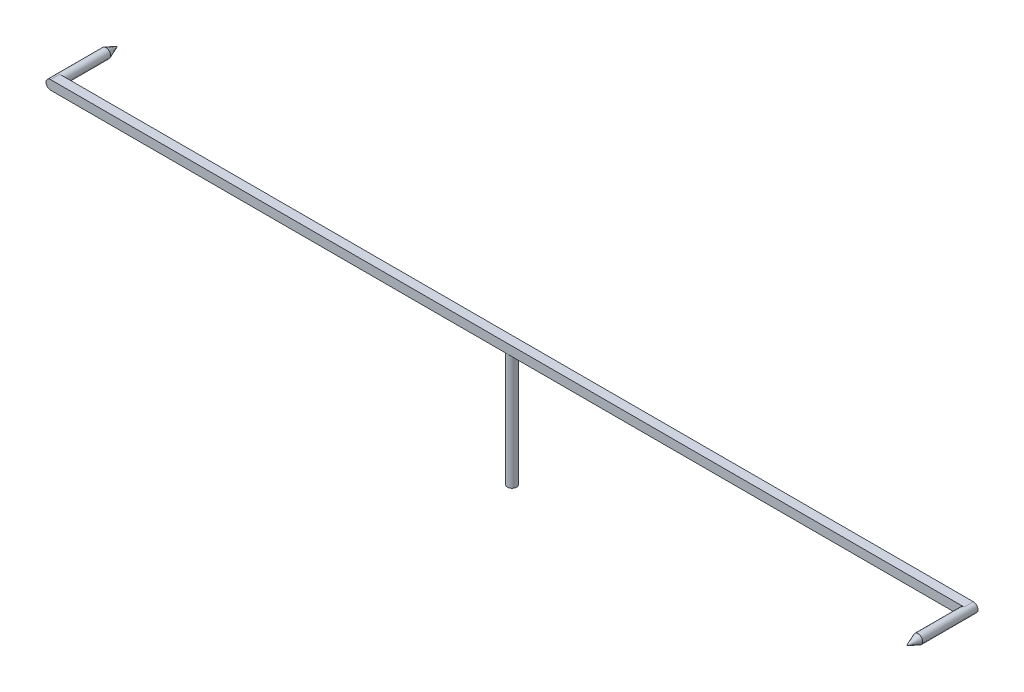
ISO-10303-21;
HEADER;
FILE_DESCRIPTION(('STEP AP214'),'2;1');
FILE_NAME('part.step','',(''),(''),'','','');
FILE_SCHEMA(('AUTOMOTIVE_DESIGN { 1 0 10303 214 1 1 1 1 }'));
ENDSEC;
DATA;
#1=APPLICATION_CONTEXT('core data for automotive mechanical design processes');
#2=APPLICATION_PROTOCOL_DEFINITION('international standard','automotive_design',2000,#1);
#3=PRODUCT_CONTEXT('',#1,'mechanical');
#4=PRODUCT('Part','Part','',(#3));
#5=PRODUCT_RELATED_PRODUCT_CATEGORY('part','',(#4));
#6=PRODUCT_DEFINITION_FORMATION('','',#4);
#7=PRODUCT_DEFINITION_CONTEXT('part definition',#1,'design');
#8=PRODUCT_DEFINITION('design','',#6,#7);
#9=PRODUCT_DEFINITION_SHAPE('','',#8);
#10=(LENGTH_UNIT() NAMED_UNIT(*) SI_UNIT(.MILLI.,.METRE.));
#11=(NAMED_UNIT(*) PLANE_ANGLE_UNIT() SI_UNIT($,.RADIAN.));
#12=(NAMED_UNIT(*) SI_UNIT($,.STERADIAN.) SOLID_ANGLE_UNIT());
#13=UNCERTAINTY_MEASURE_WITH_UNIT(LENGTH_MEASURE(1.E-05),#10,'distance_accuracy_value','');
#14=(GEOMETRIC_REPRESENTATION_CONTEXT(3) GLOBAL_UNCERTAINTY_ASSIGNED_CONTEXT((#13)) GLOBAL_UNIT_ASSIGNED_CONTEXT((#10,
#11,#12)) REPRESENTATION_CONTEXT('',''));
#15=CARTESIAN_POINT('',(0.,0.,0.));
#16=DIRECTION('',(0.,0.,1.));
#17=DIRECTION('',(1.,0.,0.));
#18=AXIS2_PLACEMENT_3D('',#15,#16,#17);
#19=CARTESIAN_POINT('',(0.,10.,0.));
#20=DIRECTION('',(0.,-1.,0.));
#21=DIRECTION('',(0.,0.,-1.));
#22=AXIS2_PLACEMENT_3D('',#19,#20,#21);
#23=CYLINDRICAL_SURFACE('',#22,0.4);
#24=CARTESIAN_POINT('',(0.,10.,0.));
#25=DIRECTION('',(0.,1.,0.));
#26=DIRECTION('',(0.,0.,1.));
#27=AXIS2_PLACEMENT_3D('',#24,#25,#26);
#28=CIRCLE('',#27,0.4);
#29=CARTESIAN_POINT('',(0.,10.,0.4));
#30=VERTEX_POINT('',#29);
#31=CARTESIAN_POINT('',(0.,10.,-0.4));
#32=VERTEX_POINT('',#31);
#33=EDGE_CURVE('E164',#30,#32,#28,.T.);
#34=ORIENTED_EDGE('',*,*,#33,.F.);
#35=EDGE_CURVE('E168',#32,#30,#28,.T.);
#36=ORIENTED_EDGE('',*,*,#35,.F.);
#37=EDGE_LOOP('',(#34,#36));
#38=FACE_BOUND('',#37,.T.);
#39=CARTESIAN_POINT('',(0.,0.,0.));
#40=DIRECTION('',(0.,1.,0.));
#41=DIRECTION('',(0.,0.,1.));
#42=AXIS2_PLACEMENT_3D('',#39,#40,#41);
#43=CIRCLE('',#42,0.4);
#44=CARTESIAN_POINT('',(0.,0.,0.4));
#45=VERTEX_POINT('',#44);
#46=EDGE_CURVE('E158',#45,#45,#43,.T.);
#47=ORIENTED_EDGE('',*,*,#46,.T.);
#48=EDGE_LOOP('',(#47));
#49=FACE_BOUND('',#48,.T.);
#50=ADVANCED_FACE('F37',(#38,#49),#23,.T.);
#51=CARTESIAN_POINT('',(0.,0.,0.));
#52=DIRECTION('',(0.,1.,0.));
#53=DIRECTION('',(0.,0.,1.));
#54=AXIS2_PLACEMENT_3D('',#51,#52,#53);
#55=PLANE('',#54);
#56=ORIENTED_EDGE('',*,*,#46,.F.);
#57=EDGE_LOOP('',(#56));
#58=FACE_BOUND('',#57,.T.);
#59=ADVANCED_FACE('F114',(#58),#55,.F.);
#60=CARTESIAN_POINT('',(0.,10.,0.));
#61=DIRECTION('',(0.,1.,0.));
#62=DIRECTION('',(0.,0.,1.));
#63=AXIS2_PLACEMENT_3D('',#60,#61,#62);
#64=PLANE('',#63);
#65=DIRECTION('',(-1.,0.,0.));
#66=VECTOR('',#65,1.);
#67=CARTESIAN_POINT('',(-40.,10.,-0.4));
#68=LINE('',#67,#66);
#69=CARTESIAN_POINT('',(39.6,10.,-0.4));
#70=VERTEX_POINT('',#69);
#71=EDGE_CURVE('E156',#70,#32,#68,.T.);
#72=ORIENTED_EDGE('',*,*,#71,.F.);
#73=DIRECTION('',(0.,0.,-1.));
#74=VECTOR('',#73,1.);
#75=CARTESIAN_POINT('',(39.6,10.,0.));
#76=LINE('',#75,#74);
#77=CARTESIAN_POINT('',(39.6,10.,0.4));
#78=VERTEX_POINT('',#77);
#79=EDGE_CURVE('E11',#70,#78,#76,.F.);
#80=ORIENTED_EDGE('',*,*,#79,.T.);
#81=DIRECTION('',(1.,0.,0.));
#82=VECTOR('',#81,1.);
#83=CARTESIAN_POINT('',(-40.,10.,0.4));
#84=LINE('',#83,#82);
#85=EDGE_CURVE('E162',#30,#78,#84,.T.);
#86=ORIENTED_EDGE('',*,*,#85,.F.);
#87=ORIENTED_EDGE('',*,*,#33,.T.);
#88=EDGE_LOOP('',(#72,#80,#86,#87));
#89=FACE_BOUND('',#88,.T.);
#90=ADVANCED_FACE('F120',(#89),#64,.F.);
#91=CARTESIAN_POINT('',(-39.6,10.,0.4));
#92=VERTEX_POINT('',#91);
#93=EDGE_CURVE('E159',#92,#30,#84,.T.);
#94=ORIENTED_EDGE('',*,*,#93,.F.);
#95=DIRECTION('',(0.,0.,1.));
#96=VECTOR('',#95,1.);
#97=CARTESIAN_POINT('',(-39.6,10.,0.));
#98=LINE('',#97,#96);
#99=CARTESIAN_POINT('',(-39.6,10.,-0.4));
#100=VERTEX_POINT('',#99);
#101=EDGE_CURVE('E174',#92,#100,#98,.F.);
#102=ORIENTED_EDGE('',*,*,#101,.T.);
#103=EDGE_CURVE('E161',#32,#100,#68,.T.);
#104=ORIENTED_EDGE('',*,*,#103,.F.);
#105=ORIENTED_EDGE('',*,*,#35,.T.);
#106=EDGE_LOOP('',(#94,#102,#104,#105));
#107=FACE_BOUND('',#106,.T.);
#108=ADVANCED_FACE('F197',(#107),#64,.F.);
#109=CARTESIAN_POINT('',(-40.,10.8,0.4));
#110=DIRECTION('',(0.,0.,-1.));
#111=DIRECTION('',(-1.,0.,0.));
#112=AXIS2_PLACEMENT_3D('',#109,#110,#111);
#113=PLANE('',#112);
#114=CARTESIAN_POINT('',(39.6,10.4,0.4));
#115=DIRECTION('',(0.,0.,1.));
#116=DIRECTION('',(1.,0.,0.));
#117=AXIS2_PLACEMENT_3D('',#114,#115,#116);
#118=CIRCLE('',#117,0.399999999999998);
#119=CARTESIAN_POINT('',(39.6,10.8,0.4));
#120=VERTEX_POINT('',#119);
#121=EDGE_CURVE('E143',#120,#78,#118,.T.);
#122=ORIENTED_EDGE('',*,*,#121,.F.);
#123=DIRECTION('',(1.,0.,0.));
#124=VECTOR('',#123,1.);
#125=CARTESIAN_POINT('',(-40.,10.8,0.4));
#126=LINE('',#125,#124);
#127=CARTESIAN_POINT('',(-39.6,10.8,0.4));
#128=VERTEX_POINT('',#127);
#129=EDGE_CURVE('E152',#128,#120,#126,.T.);
#130=ORIENTED_EDGE('',*,*,#129,.F.);
#131=CARTESIAN_POINT('',(-39.6,10.4,0.4));
#132=DIRECTION('',(0.,0.,-1.));
#133=DIRECTION('',(-1.,0.,0.));
#134=AXIS2_PLACEMENT_3D('',#131,#132,#133);
#135=CIRCLE('',#134,0.4);
#136=CARTESIAN_POINT('',(-40.,10.4,0.4));
#137=VERTEX_POINT('',#136);
#138=EDGE_CURVE('E167',#128,#137,#135,.F.);
#139=ORIENTED_EDGE('',*,*,#138,.T.);
#140=CARTESIAN_POINT('',(-39.6,10.4,0.4));
#141=DIRECTION('',(0.,0.,-1.));
#142=DIRECTION('',(-1.,0.,0.));
#143=AXIS2_PLACEMENT_3D('',#140,#141,#142);
#144=CIRCLE('',#143,0.4);
#145=EDGE_CURVE('E172',#137,#92,#144,.F.);
#146=ORIENTED_EDGE('',*,*,#145,.T.);
#147=ORIENTED_EDGE('',*,*,#93,.T.);
#148=ORIENTED_EDGE('',*,*,#85,.T.);
#149=EDGE_LOOP('',(#122,#130,#139,#146,#147,#148));
#150=FACE_BOUND('',#149,.T.);
#151=ADVANCED_FACE('F200',(#150),#113,.F.);
#152=CARTESIAN_POINT('',(-40.,10.8,-0.4));
#153=DIRECTION('',(0.,0.,1.));
#154=DIRECTION('',(1.,0.,0.));
#155=AXIS2_PLACEMENT_3D('',#152,#153,#154);
#156=PLANE('',#155);
#157=CARTESIAN_POINT('',(-39.6,10.4,-0.4));
#158=DIRECTION('',(0.,0.,-1.));
#159=DIRECTION('',(-1.,0.,0.));
#160=AXIS2_PLACEMENT_3D('',#157,#158,#159);
#161=CIRCLE('',#160,0.399999999999998);
#162=CARTESIAN_POINT('',(-39.6,10.8,-0.4));
#163=VERTEX_POINT('',#162);
#164=EDGE_CURVE('E60',#163,#100,#161,.T.);
#165=ORIENTED_EDGE('',*,*,#164,.F.);
#166=DIRECTION('',(-1.,0.,0.));
#167=VECTOR('',#166,1.);
#168=CARTESIAN_POINT('',(-40.,10.8,-0.4));
#169=LINE('',#168,#167);
#170=CARTESIAN_POINT('',(39.6,10.8,-0.4));
#171=VERTEX_POINT('',#170);
#172=EDGE_CURVE('E155',#171,#163,#169,.T.);
#173=ORIENTED_EDGE('',*,*,#172,.F.);
#174=CARTESIAN_POINT('',(39.6,10.4,-0.4));
#175=DIRECTION('',(0.,0.,1.));
#176=DIRECTION('',(1.,0.,0.));
#177=AXIS2_PLACEMENT_3D('',#174,#175,#176);
#178=CIRCLE('',#177,0.4);
#179=CARTESIAN_POINT('',(40.,10.4,-0.4));
#180=VERTEX_POINT('',#179);
#181=EDGE_CURVE('E54',#171,#180,#178,.F.);
#182=ORIENTED_EDGE('',*,*,#181,.T.);
#183=CARTESIAN_POINT('',(39.6,10.4,-0.4));
#184=DIRECTION('',(0.,0.,1.));
#185=DIRECTION('',(1.,0.,0.));
#186=AXIS2_PLACEMENT_3D('',#183,#184,#185);
#187=CIRCLE('',#186,0.4);
#188=EDGE_CURVE('E177',#180,#70,#187,.F.);
#189=ORIENTED_EDGE('',*,*,#188,.T.);
#190=ORIENTED_EDGE('',*,*,#71,.T.);
#191=ORIENTED_EDGE('',*,*,#103,.T.);
#192=EDGE_LOOP('',(#165,#173,#182,#189,#190,#191));
#193=FACE_BOUND('',#192,.T.);
#194=ADVANCED_FACE('F135',(#193),#156,.F.);
#195=CARTESIAN_POINT('',(0.,10.8,0.));
#196=DIRECTION('',(0.,1.,0.));
#197=DIRECTION('',(0.,0.,1.));
#198=AXIS2_PLACEMENT_3D('',#195,#196,#197);
#199=PLANE('',#198);
#200=ORIENTED_EDGE('',*,*,#172,.T.);
#201=DIRECTION('',(0.,0.,1.));
#202=VECTOR('',#201,1.);
#203=CARTESIAN_POINT('',(-39.6,10.8,0.4));
#204=LINE('',#203,#202);
#205=EDGE_CURVE('E46',#163,#128,#204,.T.);
#206=ORIENTED_EDGE('',*,*,#205,.T.);
#207=ORIENTED_EDGE('',*,*,#129,.T.);
#208=DIRECTION('',(0.,0.,-1.));
#209=VECTOR('',#208,1.);
#210=CARTESIAN_POINT('',(39.6,10.8,-0.4));
#211=LINE('',#210,#209);
#212=EDGE_CURVE('E179',#120,#171,#211,.T.);
#213=ORIENTED_EDGE('',*,*,#212,.T.);
#214=EDGE_LOOP('',(#200,#206,#207,#213));
#215=FACE_BOUND('',#214,.T.);
#216=ADVANCED_FACE('F128',(#215),#199,.T.);
#217=CARTESIAN_POINT('',(-39.6,10.4,0.));
#218=DIRECTION('',(0.,0.,-1.));
#219=DIRECTION('',(-1.,0.,0.));
#220=AXIS2_PLACEMENT_3D('',#217,#218,#219);
#221=CYLINDRICAL_SURFACE('',#220,0.4);
#222=ORIENTED_EDGE('',*,*,#205,.F.);
#223=ORIENTED_EDGE('',*,*,#164,.T.);
#224=ORIENTED_EDGE('',*,*,#101,.F.);
#225=ORIENTED_EDGE('',*,*,#145,.F.);
#226=DIRECTION('',(0.,0.,1.));
#227=VECTOR('',#226,1.);
#228=CARTESIAN_POINT('',(-40.,10.4,-0.4));
#229=LINE('',#228,#227);
#230=CARTESIAN_POINT('',(-40.,10.4,-0.4));
#231=VERTEX_POINT('',#230);
#232=EDGE_CURVE('E181',#137,#231,#229,.F.);
#233=ORIENTED_EDGE('',*,*,#232,.T.);
#234=ORIENTED_EDGE('',*,*,#232,.F.);
#235=ORIENTED_EDGE('',*,*,#138,.F.);
#236=EDGE_LOOP('',(#222,#223,#224,#225,#233,#234,#235));
#237=FACE_BOUND('',#236,.T.);
#238=CARTESIAN_POINT('',(-39.6,10.4,-4.4));
#239=DIRECTION('',(0.,0.,-1.));
#240=DIRECTION('',(-1.,0.,0.));
#241=AXIS2_PLACEMENT_3D('',#238,#239,#240);
#242=CIRCLE('',#241,0.399999999999998);
#243=CARTESIAN_POINT('',(-40.,10.4,-4.4));
#244=VERTEX_POINT('',#243);
#245=EDGE_CURVE('E142',#244,#244,#242,.T.);
#246=ORIENTED_EDGE('',*,*,#245,.F.);
#247=EDGE_LOOP('',(#246));
#248=FACE_BOUND('',#247,.T.);
#249=ADVANCED_FACE('F126',(#237,#248),#221,.T.);
#250=CARTESIAN_POINT('',(39.6,10.4,0.));
#251=DIRECTION('',(0.,0.,1.));
#252=DIRECTION('',(1.,0.,0.));
#253=AXIS2_PLACEMENT_3D('',#250,#251,#252);
#254=CYLINDRICAL_SURFACE('',#253,0.4);
#255=ORIENTED_EDGE('',*,*,#212,.F.);
#256=ORIENTED_EDGE('',*,*,#121,.T.);
#257=ORIENTED_EDGE('',*,*,#79,.F.);
#258=ORIENTED_EDGE('',*,*,#188,.F.);
#259=DIRECTION('',(0.,0.,-1.));
#260=VECTOR('',#259,1.);
#261=CARTESIAN_POINT('',(40.,10.4,0.4));
#262=LINE('',#261,#260);
#263=CARTESIAN_POINT('',(40.,10.4,0.4));
#264=VERTEX_POINT('',#263);
#265=EDGE_CURVE('E41',#180,#264,#262,.F.);
#266=ORIENTED_EDGE('',*,*,#265,.T.);
#267=ORIENTED_EDGE('',*,*,#265,.F.);
#268=ORIENTED_EDGE('',*,*,#181,.F.);
#269=EDGE_LOOP('',(#255,#256,#257,#258,#266,#267,#268));
#270=FACE_BOUND('',#269,.T.);
#271=CARTESIAN_POINT('',(39.6,10.4,4.4));
#272=DIRECTION('',(0.,0.,1.));
#273=DIRECTION('',(1.,0.,0.));
#274=AXIS2_PLACEMENT_3D('',#271,#272,#273);
#275=CIRCLE('',#274,0.399999999999998);
#276=CARTESIAN_POINT('',(40.,10.4,4.4));
#277=VERTEX_POINT('',#276);
#278=EDGE_CURVE('E146',#277,#277,#275,.T.);
#279=ORIENTED_EDGE('',*,*,#278,.F.);
#280=EDGE_LOOP('',(#279));
#281=FACE_BOUND('',#280,.T.);
#282=ADVANCED_FACE('F39',(#270,#281),#254,.T.);
#283=CARTESIAN_POINT('',(39.6,10.4,5.4));
#284=DIRECTION('',(0.,0.,-1.));
#285=DIRECTION('',(-1.,0.,0.));
#286=AXIS2_PLACEMENT_3D('',#283,#284,#285);
#287=CONICAL_SURFACE('',#286,0.,0.380506377112363);
#288=ORIENTED_EDGE('',*,*,#278,.T.);
#289=EDGE_LOOP('',(#288));
#290=FACE_BOUND('',#289,.T.);
#291=CARTESIAN_POINT('',(39.6,10.4,5.4));
#292=VERTEX_POINT('',#291);
#293=VERTEX_LOOP('',#292);
#294=FACE_BOUND('',#293,.T.);
#295=ADVANCED_FACE('F104',(#290,#294),#287,.T.);
#296=CARTESIAN_POINT('',(-39.6,10.4,-5.4));
#297=DIRECTION('',(0.,0.,1.));
#298=DIRECTION('',(1.,0.,0.));
#299=AXIS2_PLACEMENT_3D('',#296,#297,#298);
#300=CONICAL_SURFACE('',#299,0.,0.380506377112363);
#301=ORIENTED_EDGE('',*,*,#245,.T.);
#302=EDGE_LOOP('',(#301));
#303=FACE_BOUND('',#302,.T.);
#304=CARTESIAN_POINT('',(-39.6,10.4,-5.4));
#305=VERTEX_POINT('',#304);
#306=VERTEX_LOOP('',#305);
#307=FACE_BOUND('',#306,.T.);
#308=ADVANCED_FACE('F102',(#303,#307),#300,.T.);
#309=CLOSED_SHELL('',(#50,#59,#90,#108,#151,#194,#216,#249,#282,#295,#308));
#310=MANIFOLD_SOLID_BREP('B2',#309);
#311=ADVANCED_BREP_SHAPE_REPRESENTATION('',(#18,#310),#14);
#312=SHAPE_DEFINITION_REPRESENTATION(#9,#311);
ENDSEC;
END-ISO-10303-21;
